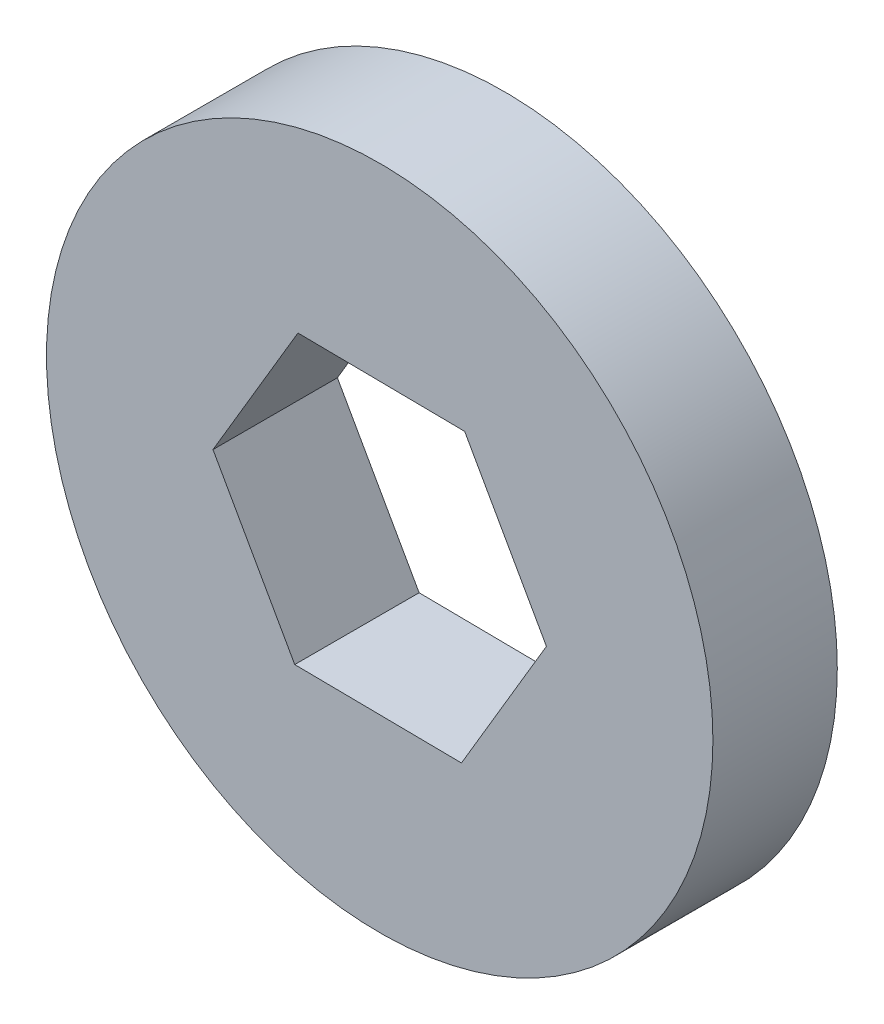
ISO-10303-21;
HEADER;
FILE_DESCRIPTION(('STEP AP214'),'2;1');
FILE_NAME('part.step','',(''),(''),'','','');
FILE_SCHEMA(('AUTOMOTIVE_DESIGN { 1 0 10303 214 1 1 1 1 }'));
ENDSEC;
DATA;
#1=APPLICATION_CONTEXT('core data for automotive mechanical design processes');
#2=APPLICATION_PROTOCOL_DEFINITION('international standard','automotive_design',2000,#1);
#3=PRODUCT_CONTEXT('',#1,'mechanical');
#4=PRODUCT('Part','Part','',(#3));
#5=PRODUCT_RELATED_PRODUCT_CATEGORY('part','',(#4));
#6=PRODUCT_DEFINITION_FORMATION('','',#4);
#7=PRODUCT_DEFINITION_CONTEXT('part definition',#1,'design');
#8=PRODUCT_DEFINITION('design','',#6,#7);
#9=PRODUCT_DEFINITION_SHAPE('','',#8);
#10=(LENGTH_UNIT() NAMED_UNIT(*) SI_UNIT(.MILLI.,.METRE.));
#11=(NAMED_UNIT(*) PLANE_ANGLE_UNIT() SI_UNIT($,.RADIAN.));
#12=(NAMED_UNIT(*) SI_UNIT($,.STERADIAN.) SOLID_ANGLE_UNIT());
#13=UNCERTAINTY_MEASURE_WITH_UNIT(LENGTH_MEASURE(1.E-05),#10,'distance_accuracy_value','');
#14=(GEOMETRIC_REPRESENTATION_CONTEXT(3) GLOBAL_UNCERTAINTY_ASSIGNED_CONTEXT((#13)) GLOBAL_UNIT_ASSIGNED_CONTEXT((#10,
#11,#12)) REPRESENTATION_CONTEXT('',''));
#15=CARTESIAN_POINT('',(0.,0.,0.));
#16=DIRECTION('',(0.,0.,1.));
#17=DIRECTION('',(1.,0.,0.));
#18=AXIS2_PLACEMENT_3D('',#15,#16,#17);
#19=CARTESIAN_POINT('',(0.,0.,5.6));
#20=DIRECTION('',(0.,0.,1.));
#21=DIRECTION('',(1.,0.,0.));
#22=AXIS2_PLACEMENT_3D('',#19,#20,#21);
#23=PLANE('',#22);
#24=CARTESIAN_POINT('',(0.,0.,5.6));
#25=DIRECTION('',(0.,0.,1.));
#26=DIRECTION('',(1.,0.,0.));
#27=AXIS2_PLACEMENT_3D('',#24,#25,#26);
#28=CIRCLE('',#27,15.);
#29=CARTESIAN_POINT('',(15.,0.,5.6));
#30=VERTEX_POINT('',#29);
#31=EDGE_CURVE('E11',#30,#30,#28,.T.);
#32=ORIENTED_EDGE('',*,*,#31,.T.);
#33=EDGE_LOOP('',(#32));
#34=FACE_BOUND('',#33,.T.);
#35=DIRECTION('',(0.509636128131462,0.860390037659184,0.));
#36=VECTOR('',#35,1.);
#37=CARTESIAN_POINT('',(3.67998463230922,-6.54148656188342,5.6));
#38=LINE('',#37,#36);
#39=CARTESIAN_POINT('',(3.67998463230922,-6.54148656188342,5.6));
#40=VERTEX_POINT('',#39);
#41=CARTESIAN_POINT('',(7.50508585726017,-0.0837831038255902,5.6));
#42=VERTEX_POINT('',#41);
#43=EDGE_CURVE('E108',#40,#42,#38,.T.);
#44=ORIENTED_EDGE('',*,*,#43,.F.);
#45=DIRECTION('',(0.999937693841634,-0.0111628148185959,0.));
#46=VECTOR('',#45,1.);
#47=CARTESIAN_POINT('',(-3.82510122495096,-6.45770345805782,5.6));
#48=LINE('',#47,#46);
#49=CARTESIAN_POINT('',(-3.82510122495096,-6.45770345805782,5.6));
#50=VERTEX_POINT('',#49);
#51=EDGE_CURVE('E99',#50,#40,#48,.T.);
#52=ORIENTED_EDGE('',*,*,#51,.F.);
#53=DIRECTION('',(0.490301565710172,-0.871552852477779,0.));
#54=VECTOR('',#53,1.);
#55=CARTESIAN_POINT('',(-7.50508585726017,0.083783103825592,5.6));
#56=LINE('',#55,#54);
#57=CARTESIAN_POINT('',(-7.50508585726017,0.0837831038255923,5.6));
#58=VERTEX_POINT('',#57);
#59=EDGE_CURVE('E133',#58,#50,#56,.T.);
#60=ORIENTED_EDGE('',*,*,#59,.F.);
#61=DIRECTION('',(-0.509636128131462,-0.860390037659184,0.));
#62=VECTOR('',#61,1.);
#63=CARTESIAN_POINT('',(-3.67998463230922,6.54148656188342,5.6));
#64=LINE('',#63,#62);
#65=CARTESIAN_POINT('',(-3.67998463230922,6.54148656188342,5.6));
#66=VERTEX_POINT('',#65);
#67=EDGE_CURVE('E130',#66,#58,#64,.T.);
#68=ORIENTED_EDGE('',*,*,#67,.F.);
#69=DIRECTION('',(-0.999937693841634,0.0111628148185958,0.));
#70=VECTOR('',#69,1.);
#71=CARTESIAN_POINT('',(3.82510122495095,6.45770345805783,5.6));
#72=LINE('',#71,#70);
#73=CARTESIAN_POINT('',(3.82510122495095,6.45770345805783,5.6));
#74=VERTEX_POINT('',#73);
#75=EDGE_CURVE('E125',#74,#66,#72,.T.);
#76=ORIENTED_EDGE('',*,*,#75,.F.);
#77=DIRECTION('',(-0.490301565710172,0.871552852477779,0.));
#78=VECTOR('',#77,1.);
#79=CARTESIAN_POINT('',(7.50508585726017,-0.0837831038255902,5.6));
#80=LINE('',#79,#78);
#81=EDGE_CURVE('E121',#42,#74,#80,.T.);
#82=ORIENTED_EDGE('',*,*,#81,.F.);
#83=EDGE_LOOP('',(#44,#52,#60,#68,#76,#82));
#84=FACE_BOUND('',#83,.T.);
#85=ADVANCED_FACE('F45',(#34,#84),#23,.T.);
#86=CARTESIAN_POINT('',(0.,0.,0.));
#87=DIRECTION('',(0.,0.,1.));
#88=DIRECTION('',(1.,0.,0.));
#89=AXIS2_PLACEMENT_3D('',#86,#87,#88);
#90=PLANE('',#89);
#91=CARTESIAN_POINT('',(0.,0.,0.));
#92=DIRECTION('',(0.,0.,1.));
#93=DIRECTION('',(1.,0.,0.));
#94=AXIS2_PLACEMENT_3D('',#91,#92,#93);
#95=CIRCLE('',#94,15.);
#96=CARTESIAN_POINT('',(15.,0.,0.));
#97=VERTEX_POINT('',#96);
#98=EDGE_CURVE('E49',#97,#97,#95,.T.);
#99=ORIENTED_EDGE('',*,*,#98,.F.);
#100=EDGE_LOOP('',(#99));
#101=FACE_BOUND('',#100,.T.);
#102=DIRECTION('',(0.999937693841634,-0.0111628148185959,0.));
#103=VECTOR('',#102,1.);
#104=CARTESIAN_POINT('',(-3.82510122495096,-6.45770345805782,0.));
#105=LINE('',#104,#103);
#106=CARTESIAN_POINT('',(-3.82510122495096,-6.45770345805782,0.));
#107=VERTEX_POINT('',#106);
#108=CARTESIAN_POINT('',(3.67998463230922,-6.54148656188342,0.));
#109=VERTEX_POINT('',#108);
#110=EDGE_CURVE('E69',#107,#109,#105,.T.);
#111=ORIENTED_EDGE('',*,*,#110,.T.);
#112=DIRECTION('',(0.509636128131462,0.860390037659184,0.));
#113=VECTOR('',#112,1.);
#114=CARTESIAN_POINT('',(3.67998463230922,-6.54148656188342,0.));
#115=LINE('',#114,#113);
#116=CARTESIAN_POINT('',(7.50508585726017,-0.0837831038255902,0.));
#117=VERTEX_POINT('',#116);
#118=EDGE_CURVE('E115',#109,#117,#115,.T.);
#119=ORIENTED_EDGE('',*,*,#118,.T.);
#120=DIRECTION('',(-0.490301565710172,0.871552852477779,0.));
#121=VECTOR('',#120,1.);
#122=CARTESIAN_POINT('',(7.50508585726017,-0.0837831038255902,0.));
#123=LINE('',#122,#121);
#124=CARTESIAN_POINT('',(3.82510122495095,6.45770345805783,0.));
#125=VERTEX_POINT('',#124);
#126=EDGE_CURVE('E140',#117,#125,#123,.T.);
#127=ORIENTED_EDGE('',*,*,#126,.T.);
#128=DIRECTION('',(-0.999937693841634,0.0111628148185958,0.));
#129=VECTOR('',#128,1.);
#130=CARTESIAN_POINT('',(3.82510122495095,6.45770345805783,0.));
#131=LINE('',#130,#129);
#132=CARTESIAN_POINT('',(-3.67998463230922,6.54148656188342,0.));
#133=VERTEX_POINT('',#132);
#134=EDGE_CURVE('E144',#125,#133,#131,.T.);
#135=ORIENTED_EDGE('',*,*,#134,.T.);
#136=DIRECTION('',(-0.509636128131462,-0.860390037659184,0.));
#137=VECTOR('',#136,1.);
#138=CARTESIAN_POINT('',(-3.67998463230922,6.54148656188342,0.));
#139=LINE('',#138,#137);
#140=CARTESIAN_POINT('',(-7.50508585726017,0.083783103825592,0.));
#141=VERTEX_POINT('',#140);
#142=EDGE_CURVE('E148',#133,#141,#139,.T.);
#143=ORIENTED_EDGE('',*,*,#142,.T.);
#144=DIRECTION('',(0.490301565710172,-0.871552852477779,0.));
#145=VECTOR('',#144,1.);
#146=CARTESIAN_POINT('',(-7.50508585726017,0.083783103825592,0.));
#147=LINE('',#146,#145);
#148=EDGE_CURVE('E109',#141,#107,#147,.T.);
#149=ORIENTED_EDGE('',*,*,#148,.T.);
#150=EDGE_LOOP('',(#111,#119,#127,#135,#143,#149));
#151=FACE_BOUND('',#150,.T.);
#152=ADVANCED_FACE('F172',(#101,#151),#90,.F.);
#153=CARTESIAN_POINT('',(0.,0.,5.6));
#154=DIRECTION('',(0.,0.,-1.));
#155=DIRECTION('',(-1.,0.,0.));
#156=AXIS2_PLACEMENT_3D('',#153,#154,#155);
#157=CYLINDRICAL_SURFACE('',#156,15.);
#158=ORIENTED_EDGE('',*,*,#31,.F.);
#159=EDGE_LOOP('',(#158));
#160=FACE_BOUND('',#159,.T.);
#161=ORIENTED_EDGE('',*,*,#98,.T.);
#162=EDGE_LOOP('',(#161));
#163=FACE_BOUND('',#162,.T.);
#164=ADVANCED_FACE('F47',(#160,#163),#157,.T.);
#165=CARTESIAN_POINT('',(-3.82510122495096,-6.45770345805782,5.6));
#166=DIRECTION('',(0.0111628148185959,0.999937693841634,0.));
#167=DIRECTION('',(-0.999937693841634,0.0111628148185959,0.));
#168=AXIS2_PLACEMENT_3D('',#165,#166,#167);
#169=PLANE('',#168);
#170=ORIENTED_EDGE('',*,*,#110,.F.);
#171=DIRECTION('',(0.,0.,-1.));
#172=VECTOR('',#171,1.);
#173=CARTESIAN_POINT('',(-3.82510122495096,-6.45770345805782,5.6));
#174=LINE('',#173,#172);
#175=EDGE_CURVE('E103',#50,#107,#174,.T.);
#176=ORIENTED_EDGE('',*,*,#175,.F.);
#177=ORIENTED_EDGE('',*,*,#51,.T.);
#178=DIRECTION('',(0.,0.,-1.));
#179=VECTOR('',#178,1.);
#180=CARTESIAN_POINT('',(3.67998463230922,-6.54148656188342,5.6));
#181=LINE('',#180,#179);
#182=EDGE_CURVE('E102',#40,#109,#181,.T.);
#183=ORIENTED_EDGE('',*,*,#182,.T.);
#184=EDGE_LOOP('',(#170,#176,#177,#183));
#185=FACE_BOUND('',#184,.T.);
#186=ADVANCED_FACE('F101',(#185),#169,.T.);
#187=CARTESIAN_POINT('',(3.67998463230922,-6.54148656188342,5.6));
#188=DIRECTION('',(-0.860390037659184,0.509636128131462,0.));
#189=DIRECTION('',(-0.509636128131462,-0.860390037659184,0.));
#190=AXIS2_PLACEMENT_3D('',#187,#188,#189);
#191=PLANE('',#190);
#192=ORIENTED_EDGE('',*,*,#118,.F.);
#193=ORIENTED_EDGE('',*,*,#182,.F.);
#194=ORIENTED_EDGE('',*,*,#43,.T.);
#195=DIRECTION('',(0.,0.,-1.));
#196=VECTOR('',#195,1.);
#197=CARTESIAN_POINT('',(7.50508585726017,-0.0837831038255902,5.6));
#198=LINE('',#197,#196);
#199=EDGE_CURVE('E117',#42,#117,#198,.T.);
#200=ORIENTED_EDGE('',*,*,#199,.T.);
#201=EDGE_LOOP('',(#192,#193,#194,#200));
#202=FACE_BOUND('',#201,.T.);
#203=ADVANCED_FACE('F112',(#202),#191,.T.);
#204=CARTESIAN_POINT('',(7.50508585726017,-0.0837831038255902,5.6));
#205=DIRECTION('',(-0.871552852477779,-0.490301565710172,0.));
#206=DIRECTION('',(0.490301565710172,-0.871552852477779,0.));
#207=AXIS2_PLACEMENT_3D('',#204,#205,#206);
#208=PLANE('',#207);
#209=ORIENTED_EDGE('',*,*,#126,.F.);
#210=ORIENTED_EDGE('',*,*,#199,.F.);
#211=ORIENTED_EDGE('',*,*,#81,.T.);
#212=DIRECTION('',(0.,0.,-1.));
#213=VECTOR('',#212,1.);
#214=CARTESIAN_POINT('',(3.82510122495095,6.45770345805783,5.6));
#215=LINE('',#214,#213);
#216=EDGE_CURVE('E162',#74,#125,#215,.T.);
#217=ORIENTED_EDGE('',*,*,#216,.T.);
#218=EDGE_LOOP('',(#209,#210,#211,#217));
#219=FACE_BOUND('',#218,.T.);
#220=ADVANCED_FACE('F168',(#219),#208,.T.);
#221=CARTESIAN_POINT('',(3.82510122495095,6.45770345805783,5.6));
#222=DIRECTION('',(-0.0111628148185958,-0.999937693841634,0.));
#223=DIRECTION('',(0.999937693841634,-0.0111628148185958,0.));
#224=AXIS2_PLACEMENT_3D('',#221,#222,#223);
#225=PLANE('',#224);
#226=ORIENTED_EDGE('',*,*,#134,.F.);
#227=ORIENTED_EDGE('',*,*,#216,.F.);
#228=ORIENTED_EDGE('',*,*,#75,.T.);
#229=DIRECTION('',(0.,0.,-1.));
#230=VECTOR('',#229,1.);
#231=CARTESIAN_POINT('',(-3.67998463230922,6.54148656188342,5.6));
#232=LINE('',#231,#230);
#233=EDGE_CURVE('E159',#66,#133,#232,.T.);
#234=ORIENTED_EDGE('',*,*,#233,.T.);
#235=EDGE_LOOP('',(#226,#227,#228,#234));
#236=FACE_BOUND('',#235,.T.);
#237=ADVANCED_FACE('F180',(#236),#225,.T.);
#238=CARTESIAN_POINT('',(-3.67998463230922,6.54148656188342,5.6));
#239=DIRECTION('',(0.860390037659184,-0.509636128131462,0.));
#240=DIRECTION('',(0.509636128131462,0.860390037659184,0.));
#241=AXIS2_PLACEMENT_3D('',#238,#239,#240);
#242=PLANE('',#241);
#243=ORIENTED_EDGE('',*,*,#142,.F.);
#244=ORIENTED_EDGE('',*,*,#233,.F.);
#245=ORIENTED_EDGE('',*,*,#67,.T.);
#246=DIRECTION('',(0.,0.,-1.));
#247=VECTOR('',#246,1.);
#248=CARTESIAN_POINT('',(-7.50508585726017,0.083783103825592,5.6));
#249=LINE('',#248,#247);
#250=EDGE_CURVE('E61',#58,#141,#249,.T.);
#251=ORIENTED_EDGE('',*,*,#250,.T.);
#252=EDGE_LOOP('',(#243,#244,#245,#251));
#253=FACE_BOUND('',#252,.T.);
#254=ADVANCED_FACE('F178',(#253),#242,.T.);
#255=CARTESIAN_POINT('',(-7.50508585726017,0.083783103825592,5.6));
#256=DIRECTION('',(0.871552852477779,0.490301565710172,0.));
#257=DIRECTION('',(-0.490301565710172,0.871552852477779,0.));
#258=AXIS2_PLACEMENT_3D('',#255,#256,#257);
#259=PLANE('',#258);
#260=ORIENTED_EDGE('',*,*,#148,.F.);
#261=ORIENTED_EDGE('',*,*,#250,.F.);
#262=ORIENTED_EDGE('',*,*,#59,.T.);
#263=ORIENTED_EDGE('',*,*,#175,.T.);
#264=EDGE_LOOP('',(#260,#261,#262,#263));
#265=FACE_BOUND('',#264,.T.);
#266=ADVANCED_FACE('F174',(#265),#259,.T.);
#267=CLOSED_SHELL('',(#85,#152,#164,#186,#203,#220,#237,#254,#266));
#268=MANIFOLD_SOLID_BREP('B2',#267);
#269=ADVANCED_BREP_SHAPE_REPRESENTATION('',(#18,#268),#14);
#270=SHAPE_DEFINITION_REPRESENTATION(#9,#269);
ENDSEC;
END-ISO-10303-21;
